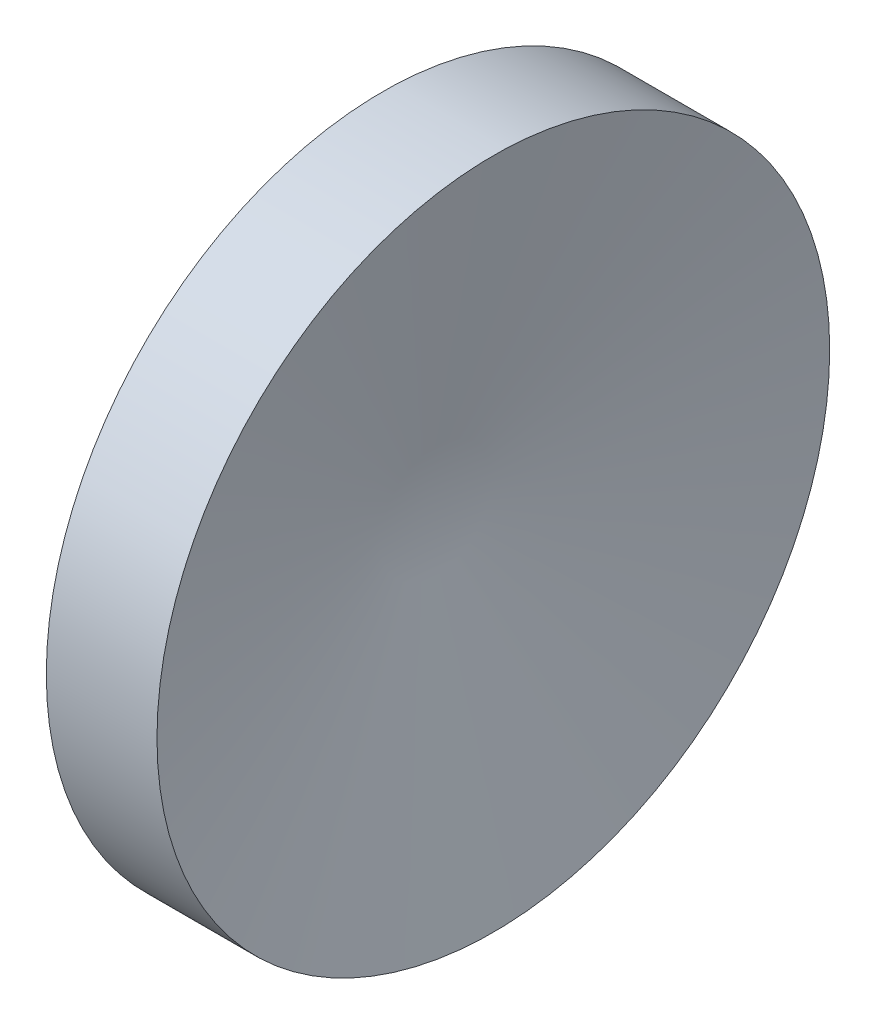
ISO-10303-21;
HEADER;
FILE_DESCRIPTION(('STEP AP214'),'2;1');
FILE_NAME('part.step','',(''),(''),'','','');
FILE_SCHEMA(('AUTOMOTIVE_DESIGN { 1 0 10303 214 1 1 1 1 }'));
ENDSEC;
DATA;
#1=APPLICATION_CONTEXT('core data for automotive mechanical design processes');
#2=APPLICATION_PROTOCOL_DEFINITION('international standard','automotive_design',2000,#1);
#3=PRODUCT_CONTEXT('',#1,'mechanical');
#4=PRODUCT('Part','Part','',(#3));
#5=PRODUCT_RELATED_PRODUCT_CATEGORY('part','',(#4));
#6=PRODUCT_DEFINITION_FORMATION('','',#4);
#7=PRODUCT_DEFINITION_CONTEXT('part definition',#1,'design');
#8=PRODUCT_DEFINITION('design','',#6,#7);
#9=PRODUCT_DEFINITION_SHAPE('','',#8);
#10=(LENGTH_UNIT() NAMED_UNIT(*) SI_UNIT(.MILLI.,.METRE.));
#11=(NAMED_UNIT(*) PLANE_ANGLE_UNIT() SI_UNIT($,.RADIAN.));
#12=(NAMED_UNIT(*) SI_UNIT($,.STERADIAN.) SOLID_ANGLE_UNIT());
#13=UNCERTAINTY_MEASURE_WITH_UNIT(LENGTH_MEASURE(1.E-05),#10,'distance_accuracy_value','');
#14=(GEOMETRIC_REPRESENTATION_CONTEXT(3) GLOBAL_UNCERTAINTY_ASSIGNED_CONTEXT((#13)) GLOBAL_UNIT_ASSIGNED_CONTEXT((#10,
#11,#12)) REPRESENTATION_CONTEXT('',''));
#15=CARTESIAN_POINT('',(0.,0.,0.));
#16=DIRECTION('',(0.,0.,1.));
#17=DIRECTION('',(1.,0.,0.));
#18=AXIS2_PLACEMENT_3D('',#15,#16,#17);
#19=CARTESIAN_POINT('',(0.,-30.5936542243274,0.));
#20=DIRECTION('',(-1.,0.,0.));
#21=DIRECTION('',(0.,0.,1.));
#22=AXIS2_PLACEMENT_3D('',#19,#20,#21);
#23=PLANE('',#22);
#24=CARTESIAN_POINT('',(0.,-30.5936542243274,0.));
#25=DIRECTION('',(1.,0.,0.));
#26=DIRECTION('',(0.,0.,-1.));
#27=AXIS2_PLACEMENT_3D('',#24,#25,#26);
#28=CIRCLE('',#27,67.8284598761876);
#29=CARTESIAN_POINT('',(0.,-30.5936542243274,-67.8284598761876));
#30=VERTEX_POINT('',#29);
#31=EDGE_CURVE('E11',#30,#30,#28,.T.);
#32=ORIENTED_EDGE('',*,*,#31,.F.);
#33=EDGE_LOOP('',(#32));
#34=FACE_BOUND('',#33,.T.);
#35=ADVANCED_FACE('F33',(#34),#23,.T.);
#36=CARTESIAN_POINT('',(8.4258725736007,-30.5936542243274,0.));
#37=DIRECTION('',(1.,0.,0.));
#38=DIRECTION('',(0.,0.,-1.));
#39=AXIS2_PLACEMENT_3D('',#36,#37,#38);
#40=CYLINDRICAL_SURFACE('',#39,67.8284598761877);
#41=ORIENTED_EDGE('',*,*,#31,.T.);
#42=EDGE_LOOP('',(#41));
#43=FACE_BOUND('',#42,.T.);
#44=CARTESIAN_POINT('',(22.3184486928199,-30.5936542243274,0.));
#45=DIRECTION('',(1.,0.,0.));
#46=DIRECTION('',(0.,0.,-1.));
#47=AXIS2_PLACEMENT_3D('',#44,#45,#46);
#48=CIRCLE('',#47,67.8284598761878);
#49=CARTESIAN_POINT('',(22.3184486928199,-30.5936542243274,-67.8284598761878));
#50=VERTEX_POINT('',#49);
#51=EDGE_CURVE('E39',#50,#50,#48,.T.);
#52=ORIENTED_EDGE('',*,*,#51,.F.);
#53=EDGE_LOOP('',(#52));
#54=FACE_BOUND('',#53,.T.);
#55=ADVANCED_FACE('F44',(#43,#54),#40,.T.);
#56=CARTESIAN_POINT('',(8.4258725736007,-30.5936542243274,0.));
#57=DIRECTION('',(1.,0.,0.));
#58=DIRECTION('',(0.,0.,-1.));
#59=AXIS2_PLACEMENT_3D('',#56,#57,#58);
#60=CONICAL_SURFACE('',#59,0.,1.3687711703913);
#61=ORIENTED_EDGE('',*,*,#51,.T.);
#62=EDGE_LOOP('',(#61));
#63=FACE_BOUND('',#62,.T.);
#64=CARTESIAN_POINT('',(8.4258725736007,-30.5936542243274,0.));
#65=VERTEX_POINT('',#64);
#66=VERTEX_LOOP('',#65);
#67=FACE_BOUND('',#66,.T.);
#68=ADVANCED_FACE('F42',(#63,#67),#60,.F.);
#69=CLOSED_SHELL('',(#35,#55,#68));
#70=MANIFOLD_SOLID_BREP('B2',#69);
#71=ADVANCED_BREP_SHAPE_REPRESENTATION('',(#18,#70),#14);
#72=SHAPE_DEFINITION_REPRESENTATION(#9,#71);
ENDSEC;
END-ISO-10303-21;
